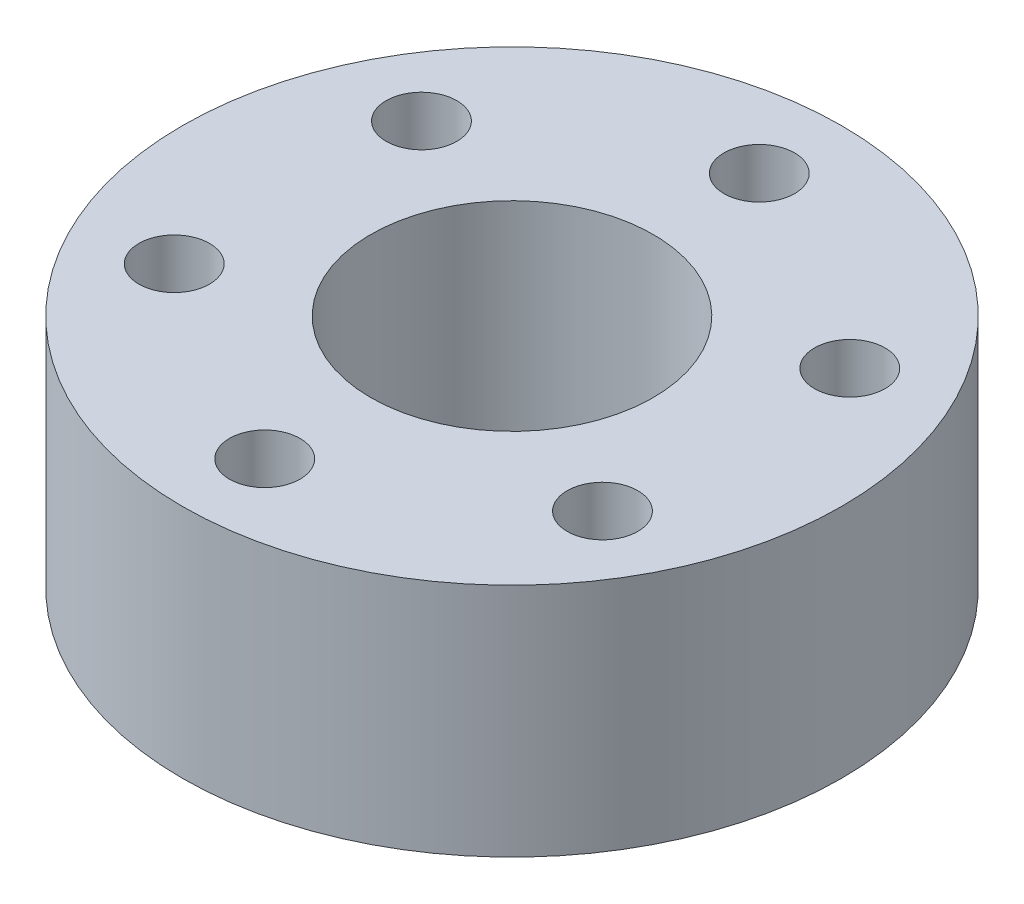
ISO-10303-21;
HEADER;
FILE_DESCRIPTION(('STEP AP214'),'2;1');
FILE_NAME('part.step','',(''),(''),'','','');
FILE_SCHEMA(('AUTOMOTIVE_DESIGN { 1 0 10303 214 1 1 1 1 }'));
ENDSEC;
DATA;
#1=APPLICATION_CONTEXT('core data for automotive mechanical design processes');
#2=APPLICATION_PROTOCOL_DEFINITION('international standard','automotive_design',2000,#1);
#3=PRODUCT_CONTEXT('',#1,'mechanical');
#4=PRODUCT('Part','Part','',(#3));
#5=PRODUCT_RELATED_PRODUCT_CATEGORY('part','',(#4));
#6=PRODUCT_DEFINITION_FORMATION('','',#4);
#7=PRODUCT_DEFINITION_CONTEXT('part definition',#1,'design');
#8=PRODUCT_DEFINITION('design','',#6,#7);
#9=PRODUCT_DEFINITION_SHAPE('','',#8);
#10=(LENGTH_UNIT() NAMED_UNIT(*) SI_UNIT(.MILLI.,.METRE.));
#11=(NAMED_UNIT(*) PLANE_ANGLE_UNIT() SI_UNIT($,.RADIAN.));
#12=(NAMED_UNIT(*) SI_UNIT($,.STERADIAN.) SOLID_ANGLE_UNIT());
#13=UNCERTAINTY_MEASURE_WITH_UNIT(LENGTH_MEASURE(1.E-05),#10,'distance_accuracy_value','');
#14=(GEOMETRIC_REPRESENTATION_CONTEXT(3) GLOBAL_UNCERTAINTY_ASSIGNED_CONTEXT((#13)) GLOBAL_UNIT_ASSIGNED_CONTEXT((#10,
#11,#12)) REPRESENTATION_CONTEXT('',''));
#15=CARTESIAN_POINT('',(0.,0.,0.));
#16=DIRECTION('',(0.,0.,1.));
#17=DIRECTION('',(1.,0.,0.));
#18=AXIS2_PLACEMENT_3D('',#15,#16,#17);
#19=CARTESIAN_POINT('',(0.,9.47368421052632,0.));
#20=DIRECTION('',(0.,-1.,0.));
#21=DIRECTION('',(0.,0.,-1.));
#22=AXIS2_PLACEMENT_3D('',#19,#20,#21);
#23=CYLINDRICAL_SURFACE('',#22,12.5263157894737);
#24=CARTESIAN_POINT('',(0.,9.47368421052632,0.));
#25=DIRECTION('',(0.,1.,0.));
#26=DIRECTION('',(0.,0.,1.));
#27=AXIS2_PLACEMENT_3D('',#24,#25,#26);
#28=CIRCLE('',#27,12.5263157894737);
#29=CARTESIAN_POINT('',(0.,9.47368421052632,12.5263157894737));
#30=VERTEX_POINT('',#29);
#31=EDGE_CURVE('E11',#30,#30,#28,.T.);
#32=ORIENTED_EDGE('',*,*,#31,.F.);
#33=EDGE_LOOP('',(#32));
#34=FACE_BOUND('',#33,.T.);
#35=CARTESIAN_POINT('',(0.,0.526315789473684,0.));
#36=DIRECTION('',(0.,1.,0.));
#37=DIRECTION('',(0.,0.,1.));
#38=AXIS2_PLACEMENT_3D('',#35,#36,#37);
#39=CIRCLE('',#38,12.5263157894737);
#40=CARTESIAN_POINT('',(0.,0.526315789473684,12.5263157894737));
#41=VERTEX_POINT('',#40);
#42=EDGE_CURVE('E44',#41,#41,#39,.T.);
#43=ORIENTED_EDGE('',*,*,#42,.T.);
#44=EDGE_LOOP('',(#43));
#45=FACE_BOUND('',#44,.T.);
#46=ADVANCED_FACE('F41',(#34,#45),#23,.T.);
#47=CARTESIAN_POINT('',(0.,9.47368421052632,0.));
#48=DIRECTION('',(0.,1.,0.));
#49=DIRECTION('',(0.,0.,1.));
#50=AXIS2_PLACEMENT_3D('',#47,#48,#49);
#51=PLANE('',#50);
#52=CARTESIAN_POINT('',(0.,9.47368421052632,-9.39473684210526));
#53=DIRECTION('',(0.,1.,0.));
#54=DIRECTION('',(0.,0.,1.));
#55=AXIS2_PLACEMENT_3D('',#52,#53,#54);
#56=CIRCLE('',#55,1.34210526315789);
#57=CARTESIAN_POINT('',(0.,9.47368421052632,-8.05263157894737));
#58=VERTEX_POINT('',#57);
#59=EDGE_CURVE('E88',#58,#58,#56,.T.);
#60=ORIENTED_EDGE('',*,*,#59,.F.);
#61=EDGE_LOOP('',(#60));
#62=FACE_BOUND('',#61,.T.);
#63=CARTESIAN_POINT('',(-8.13608076713262,9.47368421052632,4.69736842105288));
#64=DIRECTION('',(0.,1.,0.));
#65=DIRECTION('',(0.,0.,1.));
#66=AXIS2_PLACEMENT_3D('',#63,#64,#65);
#67=CIRCLE('',#66,1.3421052631579);
#68=CARTESIAN_POINT('',(-8.13608076713262,9.47368421052632,6.03947368421078));
#69=VERTEX_POINT('',#68);
#70=EDGE_CURVE('E89',#69,#69,#67,.T.);
#71=ORIENTED_EDGE('',*,*,#70,.F.);
#72=EDGE_LOOP('',(#71));
#73=FACE_BOUND('',#72,.T.);
#74=CARTESIAN_POINT('',(8.96185534810843E-13,9.47368421052632,9.39473684210527));
#75=DIRECTION('',(0.,1.,0.));
#76=DIRECTION('',(0.,0.,1.));
#77=AXIS2_PLACEMENT_3D('',#74,#75,#76);
#78=CIRCLE('',#77,1.34210526315789);
#79=CARTESIAN_POINT('',(8.96185534810843E-13,9.47368421052632,10.7368421052632));
#80=VERTEX_POINT('',#79);
#81=EDGE_CURVE('E97',#80,#80,#78,.T.);
#82=ORIENTED_EDGE('',*,*,#81,.F.);
#83=EDGE_LOOP('',(#82));
#84=FACE_BOUND('',#83,.T.);
#85=CARTESIAN_POINT('',(8.13608076713315,9.47368421052632,4.69736842105195));
#86=DIRECTION('',(0.,1.,0.));
#87=DIRECTION('',(0.,0.,1.));
#88=AXIS2_PLACEMENT_3D('',#85,#86,#87);
#89=CIRCLE('',#88,1.3421052631579);
#90=CARTESIAN_POINT('',(8.13608076713315,9.47368421052632,6.03947368420985));
#91=VERTEX_POINT('',#90);
#92=EDGE_CURVE('E55',#91,#91,#89,.T.);
#93=ORIENTED_EDGE('',*,*,#92,.F.);
#94=EDGE_LOOP('',(#93));
#95=FACE_BOUND('',#94,.T.);
#96=CARTESIAN_POINT('',(8.13608076713264,9.47368421052632,-4.69736842105282));
#97=DIRECTION('',(0.,1.,0.));
#98=DIRECTION('',(0.,0.,1.));
#99=AXIS2_PLACEMENT_3D('',#96,#97,#98);
#100=CIRCLE('',#99,1.34210526315789);
#101=CARTESIAN_POINT('',(8.13608076713264,9.47368421052632,-3.35526315789493));
#102=VERTEX_POINT('',#101);
#103=EDGE_CURVE('E64',#102,#102,#100,.T.);
#104=ORIENTED_EDGE('',*,*,#103,.F.);
#105=EDGE_LOOP('',(#104));
#106=FACE_BOUND('',#105,.T.);
#107=CARTESIAN_POINT('',(-8.1360807671327,9.47368421052632,-4.69736842105272));
#108=DIRECTION('',(0.,1.,0.));
#109=DIRECTION('',(0.,0.,1.));
#110=AXIS2_PLACEMENT_3D('',#107,#108,#109);
#111=CIRCLE('',#110,1.34210526315789);
#112=CARTESIAN_POINT('',(-8.1360807671327,9.47368421052632,-3.35526315789483));
#113=VERTEX_POINT('',#112);
#114=EDGE_CURVE('E72',#113,#113,#111,.T.);
#115=ORIENTED_EDGE('',*,*,#114,.F.);
#116=EDGE_LOOP('',(#115));
#117=FACE_BOUND('',#116,.T.);
#118=CARTESIAN_POINT('',(0.,9.47368421052632,0.));
#119=DIRECTION('',(0.,1.,0.));
#120=DIRECTION('',(0.,0.,1.));
#121=AXIS2_PLACEMENT_3D('',#118,#119,#120);
#122=CIRCLE('',#121,5.36842105263158);
#123=CARTESIAN_POINT('',(0.,9.47368421052632,5.36842105263158));
#124=VERTEX_POINT('',#123);
#125=EDGE_CURVE('E80',#124,#124,#122,.T.);
#126=ORIENTED_EDGE('',*,*,#125,.F.);
#127=EDGE_LOOP('',(#126));
#128=FACE_BOUND('',#127,.T.);
#129=ORIENTED_EDGE('',*,*,#31,.T.);
#130=EDGE_LOOP('',(#129));
#131=FACE_BOUND('',#130,.T.);
#132=ADVANCED_FACE('F121',(#62,#73,#84,#95,#106,#117,#128,#131),#51,.T.);
#133=CARTESIAN_POINT('',(0.,0.526315789473684,0.));
#134=DIRECTION('',(0.,1.,0.));
#135=DIRECTION('',(0.,0.,1.));
#136=AXIS2_PLACEMENT_3D('',#133,#134,#135);
#137=PLANE('',#136);
#138=CARTESIAN_POINT('',(0.,0.526315789473684,-9.39473684210526));
#139=DIRECTION('',(0.,1.,0.));
#140=DIRECTION('',(0.,0.,1.));
#141=AXIS2_PLACEMENT_3D('',#138,#139,#140);
#142=CIRCLE('',#141,1.34210526315789);
#143=CARTESIAN_POINT('',(0.,0.526315789473684,-8.05263157894737));
#144=VERTEX_POINT('',#143);
#145=EDGE_CURVE('E53',#144,#144,#142,.T.);
#146=ORIENTED_EDGE('',*,*,#145,.T.);
#147=EDGE_LOOP('',(#146));
#148=FACE_BOUND('',#147,.T.);
#149=CARTESIAN_POINT('',(-8.13608076713262,0.526315789473684,4.69736842105288));
#150=DIRECTION('',(0.,1.,0.));
#151=DIRECTION('',(0.,0.,1.));
#152=AXIS2_PLACEMENT_3D('',#149,#150,#151);
#153=CIRCLE('',#152,1.3421052631579);
#154=CARTESIAN_POINT('',(-8.13608076713262,0.526315789473684,6.03947368421078));
#155=VERTEX_POINT('',#154);
#156=EDGE_CURVE('E93',#155,#155,#153,.T.);
#157=ORIENTED_EDGE('',*,*,#156,.T.);
#158=EDGE_LOOP('',(#157));
#159=FACE_BOUND('',#158,.T.);
#160=CARTESIAN_POINT('',(8.96185534810843E-13,0.526315789473684,9.39473684210527));
#161=DIRECTION('',(0.,1.,0.));
#162=DIRECTION('',(0.,0.,1.));
#163=AXIS2_PLACEMENT_3D('',#160,#161,#162);
#164=CIRCLE('',#163,1.34210526315789);
#165=CARTESIAN_POINT('',(8.96185534810843E-13,0.526315789473684,10.7368421052632));
#166=VERTEX_POINT('',#165);
#167=EDGE_CURVE('E60',#166,#166,#164,.T.);
#168=ORIENTED_EDGE('',*,*,#167,.T.);
#169=EDGE_LOOP('',(#168));
#170=FACE_BOUND('',#169,.T.);
#171=CARTESIAN_POINT('',(8.13608076713315,0.526315789473684,4.69736842105195));
#172=DIRECTION('',(0.,1.,0.));
#173=DIRECTION('',(0.,0.,1.));
#174=AXIS2_PLACEMENT_3D('',#171,#172,#173);
#175=CIRCLE('',#174,1.3421052631579);
#176=CARTESIAN_POINT('',(8.13608076713315,0.526315789473684,6.03947368420985));
#177=VERTEX_POINT('',#176);
#178=EDGE_CURVE('E59',#177,#177,#175,.T.);
#179=ORIENTED_EDGE('',*,*,#178,.T.);
#180=EDGE_LOOP('',(#179));
#181=FACE_BOUND('',#180,.T.);
#182=CARTESIAN_POINT('',(8.13608076713264,0.526315789473684,-4.69736842105282));
#183=DIRECTION('',(0.,1.,0.));
#184=DIRECTION('',(0.,0.,1.));
#185=AXIS2_PLACEMENT_3D('',#182,#183,#184);
#186=CIRCLE('',#185,1.34210526315789);
#187=CARTESIAN_POINT('',(8.13608076713264,0.526315789473684,-3.35526315789493));
#188=VERTEX_POINT('',#187);
#189=EDGE_CURVE('E68',#188,#188,#186,.T.);
#190=ORIENTED_EDGE('',*,*,#189,.T.);
#191=EDGE_LOOP('',(#190));
#192=FACE_BOUND('',#191,.T.);
#193=CARTESIAN_POINT('',(-8.1360807671327,0.526315789473684,-4.69736842105272));
#194=DIRECTION('',(0.,1.,0.));
#195=DIRECTION('',(0.,0.,1.));
#196=AXIS2_PLACEMENT_3D('',#193,#194,#195);
#197=CIRCLE('',#196,1.34210526315789);
#198=CARTESIAN_POINT('',(-8.1360807671327,0.526315789473684,-3.35526315789483));
#199=VERTEX_POINT('',#198);
#200=EDGE_CURVE('E76',#199,#199,#197,.T.);
#201=ORIENTED_EDGE('',*,*,#200,.T.);
#202=EDGE_LOOP('',(#201));
#203=FACE_BOUND('',#202,.T.);
#204=CARTESIAN_POINT('',(0.,0.526315789473684,0.));
#205=DIRECTION('',(0.,1.,0.));
#206=DIRECTION('',(0.,0.,1.));
#207=AXIS2_PLACEMENT_3D('',#204,#205,#206);
#208=CIRCLE('',#207,5.36842105263158);
#209=CARTESIAN_POINT('',(0.,0.526315789473684,5.36842105263158));
#210=VERTEX_POINT('',#209);
#211=EDGE_CURVE('E84',#210,#210,#208,.T.);
#212=ORIENTED_EDGE('',*,*,#211,.T.);
#213=EDGE_LOOP('',(#212));
#214=FACE_BOUND('',#213,.T.);
#215=ORIENTED_EDGE('',*,*,#42,.F.);
#216=EDGE_LOOP('',(#215));
#217=FACE_BOUND('',#216,.T.);
#218=ADVANCED_FACE('F111',(#148,#159,#170,#181,#192,#203,#214,#217),#137,.F.);
#219=CARTESIAN_POINT('',(0.,0.526315789473684,0.));
#220=DIRECTION('',(0.,1.,0.));
#221=DIRECTION('',(0.,0.,1.));
#222=AXIS2_PLACEMENT_3D('',#219,#220,#221);
#223=CYLINDRICAL_SURFACE('',#222,5.36842105263158);
#224=ORIENTED_EDGE('',*,*,#211,.F.);
#225=EDGE_LOOP('',(#224));
#226=FACE_BOUND('',#225,.T.);
#227=ORIENTED_EDGE('',*,*,#125,.T.);
#228=EDGE_LOOP('',(#227));
#229=FACE_BOUND('',#228,.T.);
#230=ADVANCED_FACE('F137',(#226,#229),#223,.F.);
#231=CARTESIAN_POINT('',(-8.1360807671327,0.526315789473684,-4.69736842105272));
#232=DIRECTION('',(0.,1.,0.));
#233=DIRECTION('',(0.,0.,1.));
#234=AXIS2_PLACEMENT_3D('',#231,#232,#233);
#235=CYLINDRICAL_SURFACE('',#234,1.34210526315789);
#236=ORIENTED_EDGE('',*,*,#200,.F.);
#237=EDGE_LOOP('',(#236));
#238=FACE_BOUND('',#237,.T.);
#239=ORIENTED_EDGE('',*,*,#114,.T.);
#240=EDGE_LOOP('',(#239));
#241=FACE_BOUND('',#240,.T.);
#242=ADVANCED_FACE('F139',(#238,#241),#235,.F.);
#243=CARTESIAN_POINT('',(8.13608076713264,0.526315789473684,-4.69736842105282));
#244=DIRECTION('',(0.,1.,0.));
#245=DIRECTION('',(0.,0.,1.));
#246=AXIS2_PLACEMENT_3D('',#243,#244,#245);
#247=CYLINDRICAL_SURFACE('',#246,1.34210526315789);
#248=ORIENTED_EDGE('',*,*,#189,.F.);
#249=EDGE_LOOP('',(#248));
#250=FACE_BOUND('',#249,.T.);
#251=ORIENTED_EDGE('',*,*,#103,.T.);
#252=EDGE_LOOP('',(#251));
#253=FACE_BOUND('',#252,.T.);
#254=ADVANCED_FACE('F146',(#250,#253),#247,.F.);
#255=CARTESIAN_POINT('',(8.13608076713315,0.526315789473684,4.69736842105195));
#256=DIRECTION('',(0.,1.,0.));
#257=DIRECTION('',(0.,0.,1.));
#258=AXIS2_PLACEMENT_3D('',#255,#256,#257);
#259=CYLINDRICAL_SURFACE('',#258,1.3421052631579);
#260=ORIENTED_EDGE('',*,*,#178,.F.);
#261=EDGE_LOOP('',(#260));
#262=FACE_BOUND('',#261,.T.);
#263=ORIENTED_EDGE('',*,*,#92,.T.);
#264=EDGE_LOOP('',(#263));
#265=FACE_BOUND('',#264,.T.);
#266=ADVANCED_FACE('F179',(#262,#265),#259,.F.);
#267=CARTESIAN_POINT('',(8.96185534810843E-13,0.526315789473684,9.39473684210527));
#268=DIRECTION('',(0.,1.,0.));
#269=DIRECTION('',(0.,0.,1.));
#270=AXIS2_PLACEMENT_3D('',#267,#268,#269);
#271=CYLINDRICAL_SURFACE('',#270,1.34210526315789);
#272=ORIENTED_EDGE('',*,*,#167,.F.);
#273=EDGE_LOOP('',(#272));
#274=FACE_BOUND('',#273,.T.);
#275=ORIENTED_EDGE('',*,*,#81,.T.);
#276=EDGE_LOOP('',(#275));
#277=FACE_BOUND('',#276,.T.);
#278=ADVANCED_FACE('F187',(#274,#277),#271,.F.);
#279=CARTESIAN_POINT('',(-8.13608076713262,0.526315789473684,4.69736842105288));
#280=DIRECTION('',(0.,1.,0.));
#281=DIRECTION('',(0.,0.,1.));
#282=AXIS2_PLACEMENT_3D('',#279,#280,#281);
#283=CYLINDRICAL_SURFACE('',#282,1.3421052631579);
#284=ORIENTED_EDGE('',*,*,#156,.F.);
#285=EDGE_LOOP('',(#284));
#286=FACE_BOUND('',#285,.T.);
#287=ORIENTED_EDGE('',*,*,#70,.T.);
#288=EDGE_LOOP('',(#287));
#289=FACE_BOUND('',#288,.T.);
#290=ADVANCED_FACE('F117',(#286,#289),#283,.F.);
#291=CARTESIAN_POINT('',(0.,0.526315789473684,-9.39473684210526));
#292=DIRECTION('',(0.,1.,0.));
#293=DIRECTION('',(0.,0.,1.));
#294=AXIS2_PLACEMENT_3D('',#291,#292,#293);
#295=CYLINDRICAL_SURFACE('',#294,1.34210526315789);
#296=ORIENTED_EDGE('',*,*,#145,.F.);
#297=EDGE_LOOP('',(#296));
#298=FACE_BOUND('',#297,.T.);
#299=ORIENTED_EDGE('',*,*,#59,.T.);
#300=EDGE_LOOP('',(#299));
#301=FACE_BOUND('',#300,.T.);
#302=ADVANCED_FACE('F114',(#298,#301),#295,.F.);
#303=CLOSED_SHELL('',(#46,#132,#218,#230,#242,#254,#266,#278,#290,#302));
#304=MANIFOLD_SOLID_BREP('B2',#303);
#305=ADVANCED_BREP_SHAPE_REPRESENTATION('',(#18,#304),#14);
#306=SHAPE_DEFINITION_REPRESENTATION(#9,#305);
ENDSEC;
END-ISO-10303-21;
